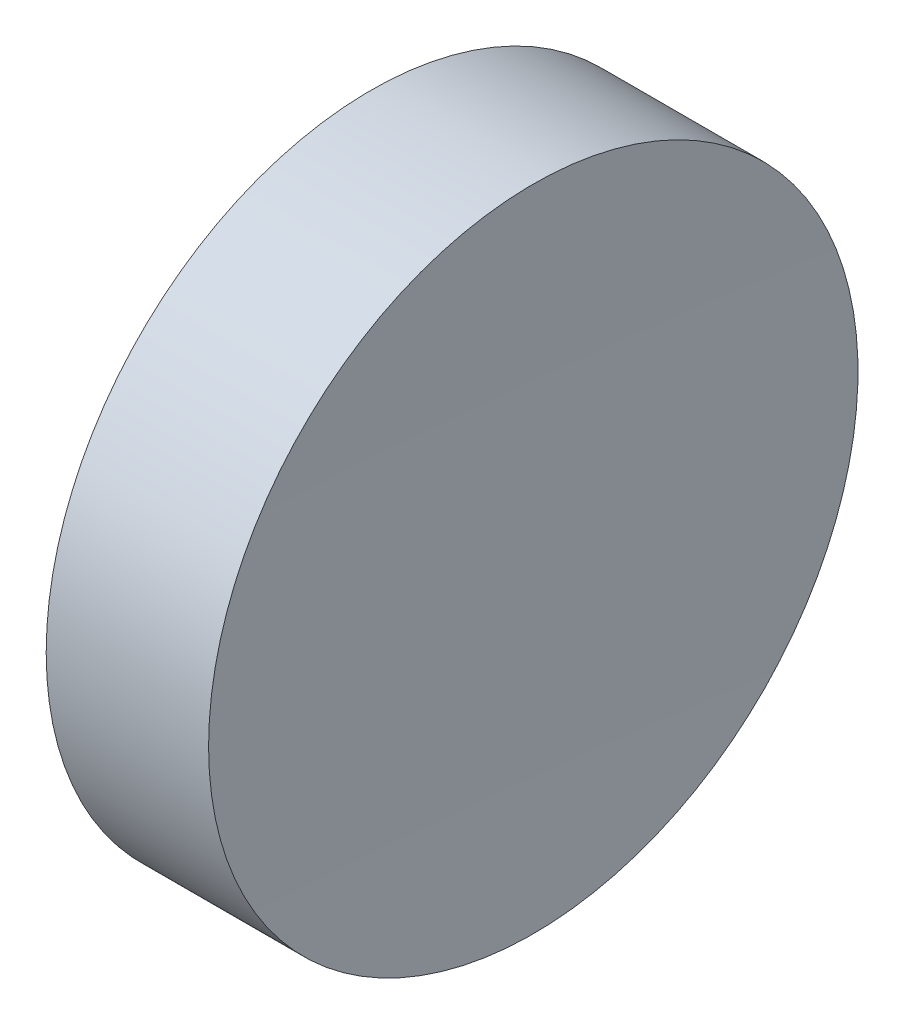
ISO-10303-21;
HEADER;
FILE_DESCRIPTION(('STEP AP214'),'2;1');
FILE_NAME('part.step','',(''),(''),'','','');
FILE_SCHEMA(('AUTOMOTIVE_DESIGN { 1 0 10303 214 1 1 1 1 }'));
ENDSEC;
DATA;
#1=APPLICATION_CONTEXT('core data for automotive mechanical design processes');
#2=APPLICATION_PROTOCOL_DEFINITION('international standard','automotive_design',2000,#1);
#3=PRODUCT_CONTEXT('',#1,'mechanical');
#4=PRODUCT('Part','Part','',(#3));
#5=PRODUCT_RELATED_PRODUCT_CATEGORY('part','',(#4));
#6=PRODUCT_DEFINITION_FORMATION('','',#4);
#7=PRODUCT_DEFINITION_CONTEXT('part definition',#1,'design');
#8=PRODUCT_DEFINITION('design','',#6,#7);
#9=PRODUCT_DEFINITION_SHAPE('','',#8);
#10=(LENGTH_UNIT() NAMED_UNIT(*) SI_UNIT(.MILLI.,.METRE.));
#11=(NAMED_UNIT(*) PLANE_ANGLE_UNIT() SI_UNIT($,.RADIAN.));
#12=(NAMED_UNIT(*) SI_UNIT($,.STERADIAN.) SOLID_ANGLE_UNIT());
#13=UNCERTAINTY_MEASURE_WITH_UNIT(LENGTH_MEASURE(1.E-05),#10,'distance_accuracy_value','');
#14=(GEOMETRIC_REPRESENTATION_CONTEXT(3) GLOBAL_UNCERTAINTY_ASSIGNED_CONTEXT((#13)) GLOBAL_UNIT_ASSIGNED_CONTEXT((#10,
#11,#12)) REPRESENTATION_CONTEXT('',''));
#15=CARTESIAN_POINT('',(0.,0.,0.));
#16=DIRECTION('',(0.,0.,1.));
#17=DIRECTION('',(1.,0.,0.));
#18=AXIS2_PLACEMENT_3D('',#15,#16,#17);
#19=CARTESIAN_POINT('',(0.,0.,0.));
#20=DIRECTION('',(1.,0.,0.));
#21=DIRECTION('',(0.,0.,-1.));
#22=AXIS2_PLACEMENT_3D('',#19,#20,#21);
#23=PLANE('',#22);
#24=CARTESIAN_POINT('',(0.,0.,0.));
#25=DIRECTION('',(-1.,0.,0.));
#26=DIRECTION('',(0.,0.,1.));
#27=AXIS2_PLACEMENT_3D('',#24,#25,#26);
#28=CIRCLE('',#27,12.7);
#29=CARTESIAN_POINT('',(0.,0.,12.7));
#30=VERTEX_POINT('',#29);
#31=EDGE_CURVE('E39',#30,#30,#28,.T.);
#32=ORIENTED_EDGE('',*,*,#31,.T.);
#33=EDGE_LOOP('',(#32));
#34=FACE_BOUND('',#33,.T.);
#35=ADVANCED_FACE('F33',(#34),#23,.F.);
#36=CARTESIAN_POINT('',(506.19,0.,0.));
#37=DIRECTION('',(-1.,0.,0.));
#38=DIRECTION('',(0.,0.,1.));
#39=AXIS2_PLACEMENT_3D('',#36,#37,#38);
#40=SPHERICAL_SURFACE('',#39,500.);
#41=CARTESIAN_POINT('',(6.35131602285927,0.,0.));
#42=DIRECTION('',(-1.,0.,0.));
#43=DIRECTION('',(0.,0.,1.));
#44=AXIS2_PLACEMENT_3D('',#41,#42,#43);
#45=CIRCLE('',#44,12.6999999999999);
#46=CARTESIAN_POINT('',(6.35131602285927,0.,12.6999999999999));
#47=VERTEX_POINT('',#46);
#48=EDGE_CURVE('E10',#47,#47,#45,.T.);
#49=ORIENTED_EDGE('',*,*,#48,.F.);
#50=EDGE_LOOP('',(#49));
#51=FACE_BOUND('',#50,.T.);
#52=ADVANCED_FACE('F48',(#51),#40,.F.);
#53=CARTESIAN_POINT('',(0.,0.,0.));
#54=DIRECTION('',(-1.,0.,0.));
#55=DIRECTION('',(0.,0.,1.));
#56=AXIS2_PLACEMENT_3D('',#53,#54,#55);
#57=CYLINDRICAL_SURFACE('',#56,12.7);
#58=ORIENTED_EDGE('',*,*,#31,.F.);
#59=EDGE_LOOP('',(#58));
#60=FACE_BOUND('',#59,.T.);
#61=ORIENTED_EDGE('',*,*,#48,.T.);
#62=EDGE_LOOP('',(#61));
#63=FACE_BOUND('',#62,.T.);
#64=ADVANCED_FACE('F46',(#60,#63),#57,.T.);
#65=CLOSED_SHELL('',(#35,#52,#64));
#66=MANIFOLD_SOLID_BREP('B2',#65);
#67=ADVANCED_BREP_SHAPE_REPRESENTATION('',(#18,#66),#14);
#68=SHAPE_DEFINITION_REPRESENTATION(#9,#67);
ENDSEC;
END-ISO-10303-21;
